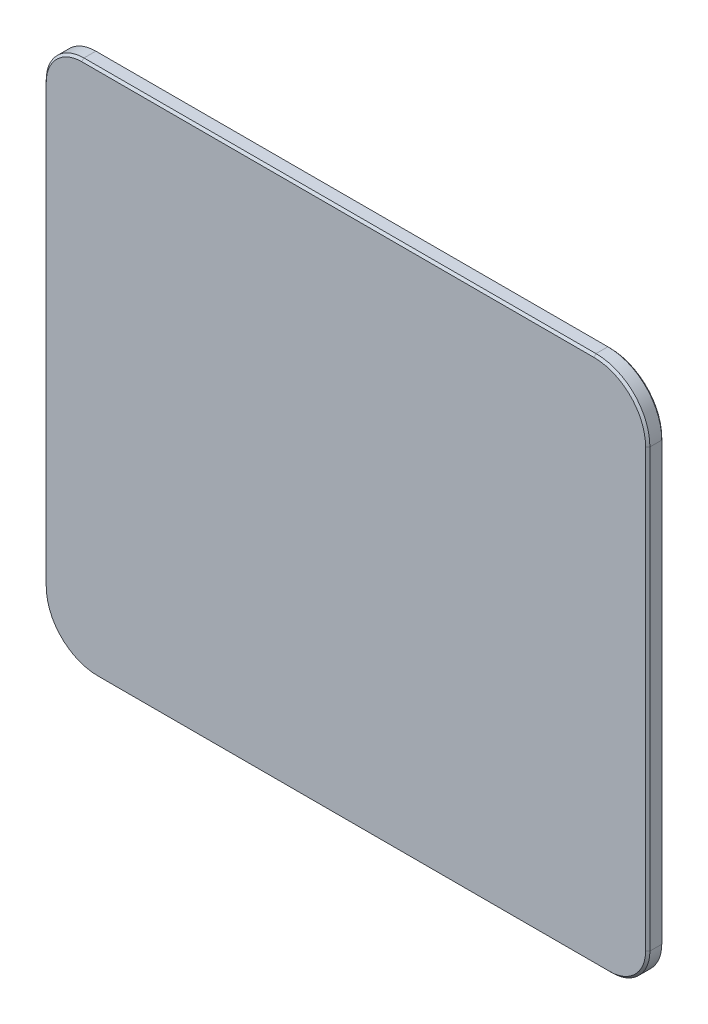
ISO-10303-21;
HEADER;
FILE_DESCRIPTION(('STEP AP214'),'2;1');
FILE_NAME('part.step','',(''),(''),'','','');
FILE_SCHEMA(('AUTOMOTIVE_DESIGN { 1 0 10303 214 1 1 1 1 }'));
ENDSEC;
DATA;
#1=APPLICATION_CONTEXT('core data for automotive mechanical design processes');
#2=APPLICATION_PROTOCOL_DEFINITION('international standard','automotive_design',2000,#1);
#3=PRODUCT_CONTEXT('',#1,'mechanical');
#4=PRODUCT('Part','Part','',(#3));
#5=PRODUCT_RELATED_PRODUCT_CATEGORY('part','',(#4));
#6=PRODUCT_DEFINITION_FORMATION('','',#4);
#7=PRODUCT_DEFINITION_CONTEXT('part definition',#1,'design');
#8=PRODUCT_DEFINITION('design','',#6,#7);
#9=PRODUCT_DEFINITION_SHAPE('','',#8);
#10=(LENGTH_UNIT() NAMED_UNIT(*) SI_UNIT(.MILLI.,.METRE.));
#11=(NAMED_UNIT(*) PLANE_ANGLE_UNIT() SI_UNIT($,.RADIAN.));
#12=(NAMED_UNIT(*) SI_UNIT($,.STERADIAN.) SOLID_ANGLE_UNIT());
#13=UNCERTAINTY_MEASURE_WITH_UNIT(LENGTH_MEASURE(1.E-05),#10,'distance_accuracy_value','');
#14=(GEOMETRIC_REPRESENTATION_CONTEXT(3) GLOBAL_UNCERTAINTY_ASSIGNED_CONTEXT((#13)) GLOBAL_UNIT_ASSIGNED_CONTEXT((#10,
#11,#12)) REPRESENTATION_CONTEXT('',''));
#15=CARTESIAN_POINT('',(0.,0.,0.));
#16=DIRECTION('',(0.,0.,1.));
#17=DIRECTION('',(1.,0.,0.));
#18=AXIS2_PLACEMENT_3D('',#15,#16,#17);
#19=CARTESIAN_POINT('',(19.,15.5,0.1));
#20=DIRECTION('',(0.,0.,-1.));
#21=DIRECTION('',(-1.,0.,0.));
#22=AXIS2_PLACEMENT_3D('',#19,#20,#21);
#23=CYLINDRICAL_SURFACE('',#22,5.);
#24=DIRECTION('',(0.,0.,-1.));
#25=VECTOR('',#24,1.);
#26=CARTESIAN_POINT('',(19.,20.5,0.12));
#27=LINE('',#26,#25);
#28=CARTESIAN_POINT('',(19.,20.5,0.12));
#29=VERTEX_POINT('',#28);
#30=CARTESIAN_POINT('',(19.,20.5,0.1));
#31=VERTEX_POINT('',#30);
#32=EDGE_CURVE('E370',#29,#31,#27,.T.);
#33=ORIENTED_EDGE('',*,*,#32,.F.);
#34=CARTESIAN_POINT('',(19.,15.5,0.12));
#35=DIRECTION('',(0.,0.,-1.));
#36=DIRECTION('',(0.,1.,0.));
#37=AXIS2_PLACEMENT_3D('',#34,#35,#36);
#38=CIRCLE('',#37,5.);
#39=CARTESIAN_POINT('',(24.,15.5,0.12));
#40=VERTEX_POINT('',#39);
#41=EDGE_CURVE('E391',#29,#40,#38,.T.);
#42=ORIENTED_EDGE('',*,*,#41,.T.);
#43=DIRECTION('',(0.,0.,1.));
#44=VECTOR('',#43,1.);
#45=CARTESIAN_POINT('',(24.,15.5,0.1));
#46=LINE('',#45,#44);
#47=CARTESIAN_POINT('',(24.,15.5,0.1));
#48=VERTEX_POINT('',#47);
#49=EDGE_CURVE('E11',#48,#40,#46,.T.);
#50=ORIENTED_EDGE('',*,*,#49,.F.);
#51=CARTESIAN_POINT('',(19.,15.5,0.1));
#52=DIRECTION('',(0.,0.,1.));
#53=DIRECTION('',(1.,0.,0.));
#54=AXIS2_PLACEMENT_3D('',#51,#52,#53);
#55=CIRCLE('',#54,5.);
#56=EDGE_CURVE('E479',#48,#31,#55,.T.);
#57=ORIENTED_EDGE('',*,*,#56,.T.);
#58=EDGE_LOOP('',(#33,#42,#50,#57));
#59=FACE_BOUND('',#58,.T.);
#60=ADVANCED_FACE('F16',(#59),#23,.T.);
#61=CARTESIAN_POINT('',(24.,7.628902816431,0.1));
#62=DIRECTION('',(-1.,0.,0.));
#63=DIRECTION('',(0.,0.,1.));
#64=AXIS2_PLACEMENT_3D('',#61,#62,#63);
#65=PLANE('',#64);
#66=ORIENTED_EDGE('',*,*,#49,.T.);
#67=DIRECTION('',(0.,-1.,0.));
#68=VECTOR('',#67,1.);
#69=CARTESIAN_POINT('',(24.,15.5,0.12));
#70=LINE('',#69,#68);
#71=CARTESIAN_POINT('',(24.,7.628902816431,0.12));
#72=VERTEX_POINT('',#71);
#73=EDGE_CURVE('E465',#40,#72,#70,.T.);
#74=ORIENTED_EDGE('',*,*,#73,.T.);
#75=DIRECTION('',(0.,4.130029651606E-12,-1.));
#76=VECTOR('',#75,1.);
#77=CARTESIAN_POINT('',(24.,7.628902816431,0.12));
#78=LINE('',#77,#76);
#79=CARTESIAN_POINT('',(24.,7.628902816431,0.1));
#80=VERTEX_POINT('',#79);
#81=EDGE_CURVE('E27',#72,#80,#78,.T.);
#82=ORIENTED_EDGE('',*,*,#81,.T.);
#83=DIRECTION('',(0.,-1.,0.));
#84=VECTOR('',#83,1.);
#85=CARTESIAN_POINT('',(24.,15.5,0.1));
#86=LINE('',#85,#84);
#87=EDGE_CURVE('E483',#48,#80,#86,.T.);
#88=ORIENTED_EDGE('',*,*,#87,.F.);
#89=EDGE_LOOP('',(#66,#74,#82,#88));
#90=FACE_BOUND('',#89,.T.);
#91=ADVANCED_FACE('F581',(#90),#65,.F.);
#92=CARTESIAN_POINT('',(-1.,0.4874743878878,0.1));
#93=DIRECTION('',(0.,0.,-1.));
#94=DIRECTION('',(-1.,0.,0.));
#95=AXIS2_PLACEMENT_3D('',#92,#93,#94);
#96=CYLINDRICAL_SURFACE('',#95,26.);
#97=ORIENTED_EDGE('',*,*,#81,.F.);
#98=CARTESIAN_POINT('',(-1.,0.4874743878878,0.12));
#99=DIRECTION('',(0.,0.,-1.));
#100=DIRECTION('',(0.961538461538471,0.274670324174692,0.));
#101=AXIS2_PLACEMENT_3D('',#98,#99,#100);
#102=CIRCLE('',#101,26.);
#103=CARTESIAN_POINT('',(25.,0.4874743878878,0.12));
#104=VERTEX_POINT('',#103);
#105=EDGE_CURVE('E461',#72,#104,#102,.T.);
#106=ORIENTED_EDGE('',*,*,#105,.T.);
#107=CARTESIAN_POINT('',(-1.,0.4874743878878,0.12));
#108=DIRECTION('',(0.,0.,-1.));
#109=DIRECTION('',(1.,0.,0.));
#110=AXIS2_PLACEMENT_3D('',#107,#108,#109);
#111=CIRCLE('',#110,26.);
#112=CARTESIAN_POINT('',(24.,-6.653954040655,0.12));
#113=VERTEX_POINT('',#112);
#114=EDGE_CURVE('E458',#104,#113,#111,.T.);
#115=ORIENTED_EDGE('',*,*,#114,.T.);
#116=DIRECTION('',(0.,-3.01980662698E-12,1.));
#117=VECTOR('',#116,1.);
#118=CARTESIAN_POINT('',(24.,-6.653954040655,0.1));
#119=LINE('',#118,#117);
#120=CARTESIAN_POINT('',(24.,-6.653954040655,0.1));
#121=VERTEX_POINT('',#120);
#122=EDGE_CURVE('E41',#121,#113,#119,.T.);
#123=ORIENTED_EDGE('',*,*,#122,.F.);
#124=CARTESIAN_POINT('',(-1.,0.4874743878878,0.1));
#125=DIRECTION('',(0.,0.,1.));
#126=DIRECTION('',(0.961538461538471,-0.274670324174692,0.));
#127=AXIS2_PLACEMENT_3D('',#124,#125,#126);
#128=CIRCLE('',#127,26.);
#129=CARTESIAN_POINT('',(25.,0.4874743878878,0.1));
#130=VERTEX_POINT('',#129);
#131=EDGE_CURVE('E472',#121,#130,#128,.T.);
#132=ORIENTED_EDGE('',*,*,#131,.T.);
#133=CARTESIAN_POINT('',(-1.,0.4874743878878,0.1));
#134=DIRECTION('',(0.,0.,1.));
#135=DIRECTION('',(1.,0.,0.));
#136=AXIS2_PLACEMENT_3D('',#133,#134,#135);
#137=CIRCLE('',#136,26.);
#138=EDGE_CURVE('E541',#130,#80,#137,.T.);
#139=ORIENTED_EDGE('',*,*,#138,.T.);
#140=EDGE_LOOP('',(#97,#106,#115,#123,#132,#139));
#141=FACE_BOUND('',#140,.T.);
#142=ADVANCED_FACE('F591',(#141),#96,.T.);
#143=CARTESIAN_POINT('',(-19.,15.5,0.1));
#144=DIRECTION('',(0.,0.,-1.));
#145=DIRECTION('',(-1.,0.,0.));
#146=AXIS2_PLACEMENT_3D('',#143,#144,#145);
#147=CYLINDRICAL_SURFACE('',#146,5.);
#148=DIRECTION('',(0.,0.,-1.));
#149=VECTOR('',#148,1.);
#150=CARTESIAN_POINT('',(-24.,15.5,0.12));
#151=LINE('',#150,#149);
#152=CARTESIAN_POINT('',(-24.,15.5,0.12));
#153=VERTEX_POINT('',#152);
#154=CARTESIAN_POINT('',(-24.,15.5,0.1));
#155=VERTEX_POINT('',#154);
#156=EDGE_CURVE('E397',#153,#155,#151,.T.);
#157=ORIENTED_EDGE('',*,*,#156,.F.);
#158=CARTESIAN_POINT('',(-19.,15.5,0.12));
#159=DIRECTION('',(0.,0.,-1.));
#160=DIRECTION('',(-1.,0.,0.));
#161=AXIS2_PLACEMENT_3D('',#158,#159,#160);
#162=CIRCLE('',#161,5.);
#163=CARTESIAN_POINT('',(-19.,20.5,0.12));
#164=VERTEX_POINT('',#163);
#165=EDGE_CURVE('E509',#153,#164,#162,.T.);
#166=ORIENTED_EDGE('',*,*,#165,.T.);
#167=DIRECTION('',(0.,0.,1.));
#168=VECTOR('',#167,1.);
#169=CARTESIAN_POINT('',(-19.,20.5,0.1));
#170=LINE('',#169,#168);
#171=CARTESIAN_POINT('',(-19.,20.5,0.1));
#172=VERTEX_POINT('',#171);
#173=EDGE_CURVE('E281',#172,#164,#170,.T.);
#174=ORIENTED_EDGE('',*,*,#173,.F.);
#175=CARTESIAN_POINT('',(-19.,15.5,0.1));
#176=DIRECTION('',(0.,0.,1.));
#177=DIRECTION('',(0.,1.,0.));
#178=AXIS2_PLACEMENT_3D('',#175,#176,#177);
#179=CIRCLE('',#178,5.);
#180=EDGE_CURVE('E484',#172,#155,#179,.T.);
#181=ORIENTED_EDGE('',*,*,#180,.T.);
#182=EDGE_LOOP('',(#157,#166,#174,#181));
#183=FACE_BOUND('',#182,.T.);
#184=ADVANCED_FACE('F776',(#183),#147,.T.);
#185=CARTESIAN_POINT('',(-24.,15.5,0.1));
#186=DIRECTION('',(1.,0.,0.));
#187=DIRECTION('',(0.,1.,0.));
#188=AXIS2_PLACEMENT_3D('',#185,#186,#187);
#189=PLANE('',#188);
#190=DIRECTION('',(0.,4.218847493576E-12,1.));
#191=VECTOR('',#190,1.);
#192=CARTESIAN_POINT('',(-24.,7.628902816431,0.1));
#193=LINE('',#192,#191);
#194=CARTESIAN_POINT('',(-24.,7.628902816431,0.1));
#195=VERTEX_POINT('',#194);
#196=CARTESIAN_POINT('',(-24.,7.628902816431,0.12));
#197=VERTEX_POINT('',#196);
#198=EDGE_CURVE('E400',#195,#197,#193,.T.);
#199=ORIENTED_EDGE('',*,*,#198,.T.);
#200=DIRECTION('',(0.,1.,0.));
#201=VECTOR('',#200,1.);
#202=CARTESIAN_POINT('',(-24.,7.628902816431,0.12));
#203=LINE('',#202,#201);
#204=EDGE_CURVE('E457',#197,#153,#203,.T.);
#205=ORIENTED_EDGE('',*,*,#204,.T.);
#206=ORIENTED_EDGE('',*,*,#156,.T.);
#207=DIRECTION('',(0.,1.,0.));
#208=VECTOR('',#207,1.);
#209=CARTESIAN_POINT('',(-24.,7.628902816431,0.1));
#210=LINE('',#209,#208);
#211=EDGE_CURVE('E395',#195,#155,#210,.T.);
#212=ORIENTED_EDGE('',*,*,#211,.F.);
#213=EDGE_LOOP('',(#199,#205,#206,#212));
#214=FACE_BOUND('',#213,.T.);
#215=ADVANCED_FACE('F829',(#214),#189,.F.);
#216=CARTESIAN_POINT('',(1.,0.4874743878878,0.1));
#217=DIRECTION('',(0.,0.,-1.));
#218=DIRECTION('',(-1.,0.,0.));
#219=AXIS2_PLACEMENT_3D('',#216,#217,#218);
#220=CYLINDRICAL_SURFACE('',#219,26.);
#221=DIRECTION('',(0.,-3.01980662698E-12,-1.));
#222=VECTOR('',#221,1.);
#223=CARTESIAN_POINT('',(-24.,-6.653954040655,0.12));
#224=LINE('',#223,#222);
#225=CARTESIAN_POINT('',(-24.,-6.653954040655,0.12));
#226=VERTEX_POINT('',#225);
#227=CARTESIAN_POINT('',(-24.,-6.653954040655,0.1));
#228=VERTEX_POINT('',#227);
#229=EDGE_CURVE('E538',#226,#228,#224,.T.);
#230=ORIENTED_EDGE('',*,*,#229,.F.);
#231=CARTESIAN_POINT('',(1.,0.4874743878878,0.12));
#232=DIRECTION('',(0.,0.,-1.));
#233=DIRECTION('',(-0.961538461538471,-0.274670324174692,0.));
#234=AXIS2_PLACEMENT_3D('',#231,#232,#233);
#235=CIRCLE('',#234,26.);
#236=CARTESIAN_POINT('',(-25.,0.4874743878878,0.12));
#237=VERTEX_POINT('',#236);
#238=EDGE_CURVE('E331',#226,#237,#235,.T.);
#239=ORIENTED_EDGE('',*,*,#238,.T.);
#240=CARTESIAN_POINT('',(1.,0.4874743878878,0.12));
#241=DIRECTION('',(0.,0.,-1.));
#242=DIRECTION('',(-1.,0.,0.));
#243=AXIS2_PLACEMENT_3D('',#240,#241,#242);
#244=CIRCLE('',#243,26.);
#245=EDGE_CURVE('E335',#237,#197,#244,.T.);
#246=ORIENTED_EDGE('',*,*,#245,.T.);
#247=ORIENTED_EDGE('',*,*,#198,.F.);
#248=CARTESIAN_POINT('',(1.,0.4874743878878,0.1));
#249=DIRECTION('',(0.,0.,1.));
#250=DIRECTION('',(-0.961538461538471,0.274670324174692,0.));
#251=AXIS2_PLACEMENT_3D('',#248,#249,#250);
#252=CIRCLE('',#251,26.);
#253=CARTESIAN_POINT('',(-25.,0.4874743878878,0.1));
#254=VERTEX_POINT('',#253);
#255=EDGE_CURVE('E392',#195,#254,#252,.T.);
#256=ORIENTED_EDGE('',*,*,#255,.T.);
#257=CARTESIAN_POINT('',(1.,0.4874743878878,0.1));
#258=DIRECTION('',(0.,0.,1.));
#259=DIRECTION('',(-1.,0.,0.));
#260=AXIS2_PLACEMENT_3D('',#257,#258,#259);
#261=CIRCLE('',#260,26.);
#262=EDGE_CURVE('E396',#254,#228,#261,.T.);
#263=ORIENTED_EDGE('',*,*,#262,.T.);
#264=EDGE_LOOP('',(#230,#239,#246,#247,#256,#263));
#265=FACE_BOUND('',#264,.T.);
#266=ADVANCED_FACE('F1007',(#265),#220,.T.);
#267=CARTESIAN_POINT('',(-24.,-6.653954040655,0.1));
#268=DIRECTION('',(1.,0.,0.));
#269=DIRECTION('',(0.,1.,0.));
#270=AXIS2_PLACEMENT_3D('',#267,#268,#269);
#271=PLANE('',#270);
#272=DIRECTION('',(0.,0.,1.));
#273=VECTOR('',#272,1.);
#274=CARTESIAN_POINT('',(-24.,-15.5,0.1));
#275=LINE('',#274,#273);
#276=CARTESIAN_POINT('',(-24.,-15.5,0.1));
#277=VERTEX_POINT('',#276);
#278=CARTESIAN_POINT('',(-24.,-15.5,0.12));
#279=VERTEX_POINT('',#278);
#280=EDGE_CURVE('E549',#277,#279,#275,.T.);
#281=ORIENTED_EDGE('',*,*,#280,.T.);
#282=DIRECTION('',(0.,1.,0.));
#283=VECTOR('',#282,1.);
#284=CARTESIAN_POINT('',(-24.,-15.5,0.12));
#285=LINE('',#284,#283);
#286=EDGE_CURVE('E334',#279,#226,#285,.T.);
#287=ORIENTED_EDGE('',*,*,#286,.T.);
#288=ORIENTED_EDGE('',*,*,#229,.T.);
#289=DIRECTION('',(0.,1.,0.));
#290=VECTOR('',#289,1.);
#291=CARTESIAN_POINT('',(-24.,-15.5,0.1));
#292=LINE('',#291,#290);
#293=EDGE_CURVE('E442',#277,#228,#292,.T.);
#294=ORIENTED_EDGE('',*,*,#293,.F.);
#295=EDGE_LOOP('',(#281,#287,#288,#294));
#296=FACE_BOUND('',#295,.T.);
#297=ADVANCED_FACE('F720',(#296),#271,.F.);
#298=CARTESIAN_POINT('',(-19.,-15.5,0.1));
#299=DIRECTION('',(0.,0.,-1.));
#300=DIRECTION('',(-1.,0.,0.));
#301=AXIS2_PLACEMENT_3D('',#298,#299,#300);
#302=CYLINDRICAL_SURFACE('',#301,5.);
#303=DIRECTION('',(0.,0.,-1.));
#304=VECTOR('',#303,1.);
#305=CARTESIAN_POINT('',(-19.,-20.5,0.12));
#306=LINE('',#305,#304);
#307=CARTESIAN_POINT('',(-19.,-20.5,0.12));
#308=VERTEX_POINT('',#307);
#309=CARTESIAN_POINT('',(-19.,-20.5,0.1));
#310=VERTEX_POINT('',#309);
#311=EDGE_CURVE('E496',#308,#310,#306,.T.);
#312=ORIENTED_EDGE('',*,*,#311,.F.);
#313=CARTESIAN_POINT('',(-19.,-15.5,0.12));
#314=DIRECTION('',(0.,0.,-1.));
#315=DIRECTION('',(0.,-1.,0.));
#316=AXIS2_PLACEMENT_3D('',#313,#314,#315);
#317=CIRCLE('',#316,5.);
#318=EDGE_CURVE('E349',#308,#279,#317,.T.);
#319=ORIENTED_EDGE('',*,*,#318,.T.);
#320=ORIENTED_EDGE('',*,*,#280,.F.);
#321=CARTESIAN_POINT('',(-19.,-15.5,0.1));
#322=DIRECTION('',(0.,0.,1.));
#323=DIRECTION('',(-1.,0.,0.));
#324=AXIS2_PLACEMENT_3D('',#321,#322,#323);
#325=CIRCLE('',#324,5.);
#326=EDGE_CURVE('E446',#277,#310,#325,.T.);
#327=ORIENTED_EDGE('',*,*,#326,.T.);
#328=EDGE_LOOP('',(#312,#319,#320,#327));
#329=FACE_BOUND('',#328,.T.);
#330=ADVANCED_FACE('F713',(#329),#302,.T.);
#331=CARTESIAN_POINT('',(-19.,-20.5,0.1));
#332=DIRECTION('',(0.,1.,0.));
#333=DIRECTION('',(1.,0.,0.));
#334=AXIS2_PLACEMENT_3D('',#331,#332,#333);
#335=PLANE('',#334);
#336=DIRECTION('',(0.,0.,1.));
#337=VECTOR('',#336,1.);
#338=CARTESIAN_POINT('',(19.,-20.5,0.1));
#339=LINE('',#338,#337);
#340=CARTESIAN_POINT('',(19.,-20.5,0.1));
#341=VERTEX_POINT('',#340);
#342=CARTESIAN_POINT('',(19.,-20.5,0.12));
#343=VERTEX_POINT('',#342);
#344=EDGE_CURVE('E330',#341,#343,#339,.T.);
#345=ORIENTED_EDGE('',*,*,#344,.T.);
#346=DIRECTION('',(-1.,0.,0.));
#347=VECTOR('',#346,1.);
#348=CARTESIAN_POINT('',(19.,-20.5,0.12));
#349=LINE('',#348,#347);
#350=EDGE_CURVE('E429',#343,#308,#349,.T.);
#351=ORIENTED_EDGE('',*,*,#350,.T.);
#352=ORIENTED_EDGE('',*,*,#311,.T.);
#353=DIRECTION('',(-1.,0.,0.));
#354=VECTOR('',#353,1.);
#355=CARTESIAN_POINT('',(19.,-20.5,0.1));
#356=LINE('',#355,#354);
#357=EDGE_CURVE('E493',#341,#310,#356,.T.);
#358=ORIENTED_EDGE('',*,*,#357,.F.);
#359=EDGE_LOOP('',(#345,#351,#352,#358));
#360=FACE_BOUND('',#359,.T.);
#361=ADVANCED_FACE('F719',(#360),#335,.F.);
#362=CARTESIAN_POINT('',(19.,-15.5,0.1));
#363=DIRECTION('',(0.,0.,-1.));
#364=DIRECTION('',(-1.,0.,0.));
#365=AXIS2_PLACEMENT_3D('',#362,#363,#364);
#366=CYLINDRICAL_SURFACE('',#365,5.);
#367=DIRECTION('',(0.,0.,-1.));
#368=VECTOR('',#367,1.);
#369=CARTESIAN_POINT('',(24.,-15.5,0.12));
#370=LINE('',#369,#368);
#371=CARTESIAN_POINT('',(24.,-15.5,0.12));
#372=VERTEX_POINT('',#371);
#373=CARTESIAN_POINT('',(24.,-15.5,0.1));
#374=VERTEX_POINT('',#373);
#375=EDGE_CURVE('E254',#372,#374,#370,.T.);
#376=ORIENTED_EDGE('',*,*,#375,.F.);
#377=CARTESIAN_POINT('',(19.,-15.5,0.12));
#378=DIRECTION('',(0.,0.,-1.));
#379=DIRECTION('',(1.,0.,0.));
#380=AXIS2_PLACEMENT_3D('',#377,#378,#379);
#381=CIRCLE('',#380,5.);
#382=EDGE_CURVE('E433',#372,#343,#381,.T.);
#383=ORIENTED_EDGE('',*,*,#382,.T.);
#384=ORIENTED_EDGE('',*,*,#344,.F.);
#385=CARTESIAN_POINT('',(19.,-15.5,0.1));
#386=DIRECTION('',(0.,0.,1.));
#387=DIRECTION('',(0.,-1.,0.));
#388=AXIS2_PLACEMENT_3D('',#385,#386,#387);
#389=CIRCLE('',#388,5.);
#390=EDGE_CURVE('E520',#341,#374,#389,.T.);
#391=ORIENTED_EDGE('',*,*,#390,.T.);
#392=EDGE_LOOP('',(#376,#383,#384,#391));
#393=FACE_BOUND('',#392,.T.);
#394=ADVANCED_FACE('F745',(#393),#366,.T.);
#395=CARTESIAN_POINT('',(24.,-15.5,0.1));
#396=DIRECTION('',(-1.,0.,0.));
#397=DIRECTION('',(0.,0.,1.));
#398=AXIS2_PLACEMENT_3D('',#395,#396,#397);
#399=PLANE('',#398);
#400=ORIENTED_EDGE('',*,*,#122,.T.);
#401=DIRECTION('',(0.,-1.,0.));
#402=VECTOR('',#401,1.);
#403=CARTESIAN_POINT('',(24.,-6.653954040655,0.12));
#404=LINE('',#403,#402);
#405=EDGE_CURVE('E462',#113,#372,#404,.T.);
#406=ORIENTED_EDGE('',*,*,#405,.T.);
#407=ORIENTED_EDGE('',*,*,#375,.T.);
#408=DIRECTION('',(0.,-1.,0.));
#409=VECTOR('',#408,1.);
#410=CARTESIAN_POINT('',(24.,-6.653954040655,0.1));
#411=LINE('',#410,#409);
#412=EDGE_CURVE('E468',#121,#374,#411,.T.);
#413=ORIENTED_EDGE('',*,*,#412,.F.);
#414=EDGE_LOOP('',(#400,#406,#407,#413));
#415=FACE_BOUND('',#414,.T.);
#416=ADVANCED_FACE('F750',(#415),#399,.F.);
#417=CARTESIAN_POINT('',(0.,0.,0.1));
#418=DIRECTION('',(0.,0.,-1.));
#419=DIRECTION('',(0.,-1.,0.));
#420=AXIS2_PLACEMENT_3D('',#417,#418,#419);
#421=PLANE('',#420);
#422=ORIENTED_EDGE('',*,*,#390,.F.);
#423=ORIENTED_EDGE('',*,*,#357,.T.);
#424=ORIENTED_EDGE('',*,*,#326,.F.);
#425=ORIENTED_EDGE('',*,*,#293,.T.);
#426=ORIENTED_EDGE('',*,*,#262,.F.);
#427=ORIENTED_EDGE('',*,*,#255,.F.);
#428=ORIENTED_EDGE('',*,*,#211,.T.);
#429=ORIENTED_EDGE('',*,*,#180,.F.);
#430=DIRECTION('',(1.,0.,0.));
#431=VECTOR('',#430,1.);
#432=CARTESIAN_POINT('',(-19.,20.5,0.1));
#433=LINE('',#432,#431);
#434=EDGE_CURVE('E317',#172,#31,#433,.T.);
#435=ORIENTED_EDGE('',*,*,#434,.T.);
#436=ORIENTED_EDGE('',*,*,#56,.F.);
#437=ORIENTED_EDGE('',*,*,#87,.T.);
#438=ORIENTED_EDGE('',*,*,#138,.F.);
#439=ORIENTED_EDGE('',*,*,#131,.F.);
#440=ORIENTED_EDGE('',*,*,#412,.T.);
#441=EDGE_LOOP('',(#422,#423,#424,#425,#426,#427,#428,#429,#435,#436,#437,#438,#439,#440));
#442=FACE_BOUND('',#441,.T.);
#443=ADVANCED_FACE('F599',(#442),#421,.T.);
#444=CARTESIAN_POINT('',(19.,20.5,0.1));
#445=DIRECTION('',(0.,-1.,0.));
#446=DIRECTION('',(0.,0.,-1.));
#447=AXIS2_PLACEMENT_3D('',#444,#445,#446);
#448=PLANE('',#447);
#449=ORIENTED_EDGE('',*,*,#173,.T.);
#450=DIRECTION('',(1.,0.,0.));
#451=VECTOR('',#450,1.);
#452=CARTESIAN_POINT('',(-19.,20.5,0.12));
#453=LINE('',#452,#451);
#454=EDGE_CURVE('E386',#164,#29,#453,.T.);
#455=ORIENTED_EDGE('',*,*,#454,.T.);
#456=ORIENTED_EDGE('',*,*,#32,.T.);
#457=ORIENTED_EDGE('',*,*,#434,.F.);
#458=EDGE_LOOP('',(#449,#455,#456,#457));
#459=FACE_BOUND('',#458,.T.);
#460=ADVANCED_FACE('F736',(#459),#448,.F.);
#461=CARTESIAN_POINT('',(-0.75,24.4,0.2));
#462=DIRECTION('',(0.,0.707106781186548,-0.707106781186548));
#463=DIRECTION('',(-1.,0.,0.));
#464=AXIS2_PLACEMENT_3D('',#461,#462,#463);
#465=PLANE('',#464);
#466=DIRECTION('',(8.52791882667797E-09,0.707106781667298,0.707106780705798));
#467=VECTOR('',#466,1.);
#468=CARTESIAN_POINT('',(-24.49999999591,24.32,0.12));
#469=LINE('',#468,#467);
#470=CARTESIAN_POINT('',(-24.5,24.32,0.1199999999998));
#471=VERTEX_POINT('',#470);
#472=CARTESIAN_POINT('',(-24.49999999378,24.5,0.2999999999998));
#473=VERTEX_POINT('',#472);
#474=EDGE_CURVE('E284',#471,#473,#469,.T.);
#475=ORIENTED_EDGE('',*,*,#474,.T.);
#476=DIRECTION('',(-1.,0.,0.));
#477=VECTOR('',#476,1.);
#478=CARTESIAN_POINT('',(22.99999998149,24.49999999976,0.2999999995109));
#479=LINE('',#478,#477);
#480=CARTESIAN_POINT('',(22.99999998157,24.5,0.2999999999999));
#481=VERTEX_POINT('',#480);
#482=EDGE_CURVE('E270',#481,#473,#479,.T.);
#483=ORIENTED_EDGE('',*,*,#482,.F.);
#484=DIRECTION('',(2.49128455037899E-08,-0.707106781667297,-0.707106780705797));
#485=VECTOR('',#484,1.);
#486=CARTESIAN_POINT('',(22.99999998149,24.49999999976,0.2999999995109));
#487=LINE('',#486,#485);
#488=CARTESIAN_POINT('',(23.,24.32,0.1199999999998));
#489=VERTEX_POINT('',#488);
#490=EDGE_CURVE('E424',#481,#489,#487,.T.);
#491=ORIENTED_EDGE('',*,*,#490,.T.);
#492=DIRECTION('',(-1.,0.,0.));
#493=VECTOR('',#492,1.);
#494=CARTESIAN_POINT('',(22.99999998784,24.32,0.1199999999999));
#495=LINE('',#494,#493);
#496=EDGE_CURVE('E288',#489,#471,#495,.T.);
#497=ORIENTED_EDGE('',*,*,#496,.T.);
#498=EDGE_LOOP('',(#475,#483,#491,#497));
#499=FACE_BOUND('',#498,.T.);
#500=ADVANCED_FACE('F286',(#499),#465,.T.);
#501=CARTESIAN_POINT('',(-24.5,24.5,1.6));
#502=DIRECTION('',(0.,-1.,0.));
#503=DIRECTION('',(0.,0.,-1.));
#504=AXIS2_PLACEMENT_3D('',#501,#502,#503);
#505=PLANE('',#504);
#506=DIRECTION('',(-2.861168270731E-09,2.22102740141E-10,1.));
#507=VECTOR('',#506,1.);
#508=CARTESIAN_POINT('',(-24.49999999374,24.49999999976,0.2999999995108));
#509=LINE('',#508,#507);
#510=CARTESIAN_POINT('',(-24.49999999689,24.5,1.4));
#511=VERTEX_POINT('',#510);
#512=EDGE_CURVE('E275',#473,#511,#509,.T.);
#513=ORIENTED_EDGE('',*,*,#512,.T.);
#514=DIRECTION('',(1.,0.,0.));
#515=VECTOR('',#514,1.);
#516=CARTESIAN_POINT('',(-24.49999999689,24.5,1.4));
#517=LINE('',#516,#515);
#518=CARTESIAN_POINT('',(22.99999999079,24.5,1.4));
#519=VERTEX_POINT('',#518);
#520=EDGE_CURVE('E379',#511,#519,#517,.T.);
#521=ORIENTED_EDGE('',*,*,#520,.T.);
#522=DIRECTION('',(-8.446428199566E-09,-2.22102740141E-10,-1.));
#523=VECTOR('',#522,1.);
#524=CARTESIAN_POINT('',(22.99999999079,24.5,1.4));
#525=LINE('',#524,#523);
#526=EDGE_CURVE('E277',#519,#481,#525,.T.);
#527=ORIENTED_EDGE('',*,*,#526,.T.);
#528=ORIENTED_EDGE('',*,*,#482,.T.);
#529=EDGE_LOOP('',(#513,#521,#527,#528));
#530=FACE_BOUND('',#529,.T.);
#531=ADVANCED_FACE('F272',(#530),#505,.F.);
#532=CARTESIAN_POINT('',(23.,19.5,1.6));
#533=DIRECTION('',(0.,0.,-1.));
#534=DIRECTION('',(-1.,0.,0.));
#535=AXIS2_PLACEMENT_3D('',#532,#533,#534);
#536=CYLINDRICAL_SURFACE('',#535,5.);
#537=ORIENTED_EDGE('',*,*,#526,.F.);
#538=CARTESIAN_POINT('',(23.,19.5,1.4));
#539=DIRECTION('',(0.,0.,-1.));
#540=DIRECTION('',(-3.685605065584E-09,1.,0.));
#541=AXIS2_PLACEMENT_3D('',#538,#539,#540);
#542=CIRCLE('',#541,5.);
#543=CARTESIAN_POINT('',(28.,19.49999999228,1.4));
#544=VERTEX_POINT('',#543);
#545=EDGE_CURVE('E322',#519,#544,#542,.T.);
#546=ORIENTED_EDGE('',*,*,#545,.T.);
#547=DIRECTION('',(2.331129227957E-10,7.078733555616E-09,1.));
#548=VECTOR('',#547,1.);
#549=CARTESIAN_POINT('',(27.99999999974,19.49999998449,0.2999999994875));
#550=LINE('',#549,#548);
#551=CARTESIAN_POINT('',(27.99999999974,19.49999998449,0.2999999994875));
#552=VERTEX_POINT('',#551);
#553=EDGE_CURVE('E419',#552,#544,#550,.T.);
#554=ORIENTED_EDGE('',*,*,#553,.F.);
#555=CARTESIAN_POINT('',(23.,19.5,0.2999999999999));
#556=DIRECTION('',(0.,0.,1.));
#557=DIRECTION('',(1.,-3.089472500051E-09,0.));
#558=AXIS2_PLACEMENT_3D('',#555,#556,#557);
#559=CIRCLE('',#558,5.);
#560=EDGE_CURVE('E421',#552,#481,#559,.T.);
#561=ORIENTED_EDGE('',*,*,#560,.T.);
#562=EDGE_LOOP('',(#537,#546,#554,#561));
#563=FACE_BOUND('',#562,.T.);
#564=ADVANCED_FACE('F791',(#563),#536,.T.);
#565=CARTESIAN_POINT('',(23.,19.5,0.2099999999998));
#566=DIRECTION('',(0.,0.,1.));
#567=DIRECTION('',(0.,-1.,0.));
#568=AXIS2_PLACEMENT_3D('',#565,#566,#567);
#569=CONICAL_SURFACE('',#568,4.91,0.7853981633973);
#570=ORIENTED_EDGE('',*,*,#490,.F.);
#571=ORIENTED_EDGE('',*,*,#560,.F.);
#572=DIRECTION('',(0.707106781689297,-2.08853280608899E-08,0.707106780683797));
#573=VECTOR('',#572,1.);
#574=CARTESIAN_POINT('',(27.82,19.49999998981,0.1199999999999));
#575=LINE('',#574,#573);
#576=CARTESIAN_POINT('',(27.82,19.49999998981,0.1199999999999));
#577=VERTEX_POINT('',#576);
#578=EDGE_CURVE('E542',#577,#552,#575,.T.);
#579=ORIENTED_EDGE('',*,*,#578,.F.);
#580=CARTESIAN_POINT('',(23.,19.5,0.1199999999998));
#581=DIRECTION('',(0.,0.,1.));
#582=DIRECTION('',(1.,0.,0.));
#583=AXIS2_PLACEMENT_3D('',#580,#581,#582);
#584=CIRCLE('',#583,4.82);
#585=EDGE_CURVE('E341',#577,#489,#584,.T.);
#586=ORIENTED_EDGE('',*,*,#585,.T.);
#587=EDGE_LOOP('',(#570,#571,#579,#586));
#588=FACE_BOUND('',#587,.T.);
#589=ADVANCED_FACE('F785',(#588),#569,.T.);
#590=CARTESIAN_POINT('',(27.9,-0.75,0.2));
#591=DIRECTION('',(0.707106781186548,0.,-0.707106781186548));
#592=DIRECTION('',(0.,-1.,0.));
#593=AXIS2_PLACEMENT_3D('',#590,#591,#592);
#594=PLANE('',#593);
#595=ORIENTED_EDGE('',*,*,#578,.T.);
#596=DIRECTION('',(0.,1.,0.));
#597=VECTOR('',#596,1.);
#598=CARTESIAN_POINT('',(27.99999999974,-20.99999998772,0.2999999994875));
#599=LINE('',#598,#597);
#600=CARTESIAN_POINT('',(28.,-20.99999998779,0.2999999999998));
#601=VERTEX_POINT('',#600);
#602=EDGE_CURVE('E546',#601,#552,#599,.T.);
#603=ORIENTED_EDGE('',*,*,#602,.F.);
#604=DIRECTION('',(-0.707106781689297,-1.674028396111E-08,-0.707106780683797));
#605=VECTOR('',#604,1.);
#606=CARTESIAN_POINT('',(27.99999999974,-20.99999998772,0.2999999994875));
#607=LINE('',#606,#605);
#608=CARTESIAN_POINT('',(27.82,-21.,0.1199999999998));
#609=VERTEX_POINT('',#608);
#610=EDGE_CURVE('E390',#601,#609,#607,.T.);
#611=ORIENTED_EDGE('',*,*,#610,.T.);
#612=DIRECTION('',(0.,1.,0.));
#613=VECTOR('',#612,1.);
#614=CARTESIAN_POINT('',(27.82,-20.99999999198,0.12));
#615=LINE('',#614,#613);
#616=EDGE_CURVE('E345',#609,#577,#615,.T.);
#617=ORIENTED_EDGE('',*,*,#616,.T.);
#618=EDGE_LOOP('',(#595,#603,#611,#617));
#619=FACE_BOUND('',#618,.T.);
#620=ADVANCED_FACE('F790',(#619),#594,.T.);
#621=CARTESIAN_POINT('',(28.,-21.,1.6));
#622=DIRECTION('',(-1.,0.,0.));
#623=DIRECTION('',(0.,0.,1.));
#624=AXIS2_PLACEMENT_3D('',#621,#622,#623);
#625=PLANE('',#624);
#626=ORIENTED_EDGE('',*,*,#553,.T.);
#627=DIRECTION('',(0.,-1.,0.));
#628=VECTOR('',#627,1.);
#629=CARTESIAN_POINT('',(28.,19.49999999228,1.4));
#630=LINE('',#629,#628);
#631=CARTESIAN_POINT('',(28.,-20.99999999389,1.4));
#632=VERTEX_POINT('',#631);
#633=EDGE_CURVE('E409',#544,#632,#630,.T.);
#634=ORIENTED_EDGE('',*,*,#633,.T.);
#635=DIRECTION('',(-2.331161525354E-10,5.616465673761E-09,-1.));
#636=VECTOR('',#635,1.);
#637=CARTESIAN_POINT('',(28.,-20.99999999389,1.4));
#638=LINE('',#637,#636);
#639=EDGE_CURVE('E415',#632,#601,#638,.T.);
#640=ORIENTED_EDGE('',*,*,#639,.T.);
#641=ORIENTED_EDGE('',*,*,#602,.T.);
#642=EDGE_LOOP('',(#626,#634,#640,#641));
#643=FACE_BOUND('',#642,.T.);
#644=ADVANCED_FACE('F804',(#643),#625,.F.);
#645=CARTESIAN_POINT('',(24.5,-21.,1.6));
#646=DIRECTION('',(0.,0.,-1.));
#647=DIRECTION('',(-1.,0.,0.));
#648=AXIS2_PLACEMENT_3D('',#645,#646,#647);
#649=CYLINDRICAL_SURFACE('',#648,3.5);
#650=ORIENTED_EDGE('',*,*,#639,.F.);
#651=CARTESIAN_POINT('',(24.5,-21.,1.4));
#652=DIRECTION('',(0.,0.,-1.));
#653=DIRECTION('',(1.,3.489414471655E-09,0.));
#654=AXIS2_PLACEMENT_3D('',#651,#652,#653);
#655=CIRCLE('',#654,3.5);
#656=CARTESIAN_POINT('',(24.49999999378,-24.5,1.4));
#657=VERTEX_POINT('',#656);
#658=EDGE_CURVE('E428',#632,#657,#655,.T.);
#659=ORIENTED_EDGE('',*,*,#658,.T.);
#660=DIRECTION('',(1.413999421972E-09,-2.22102740141E-10,1.));
#661=VECTOR('',#660,1.);
#662=CARTESIAN_POINT('',(24.49999999533,-24.49999999976,0.2999999995108));
#663=LINE('',#662,#661);
#664=CARTESIAN_POINT('',(24.49999999533,-24.49999999976,0.2999999995108));
#665=VERTEX_POINT('',#664);
#666=EDGE_CURVE('E374',#665,#657,#663,.T.);
#667=ORIENTED_EDGE('',*,*,#666,.F.);
#668=CARTESIAN_POINT('',(24.5,-21.,0.2999999999998));
#669=DIRECTION('',(0.,0.,1.));
#670=DIRECTION('',(-1.777595213882E-09,-1.,0.));
#671=AXIS2_PLACEMENT_3D('',#668,#669,#670);
#672=CIRCLE('',#671,3.5);
#673=EDGE_CURVE('E434',#665,#601,#672,.T.);
#674=ORIENTED_EDGE('',*,*,#673,.T.);
#675=EDGE_LOOP('',(#650,#659,#667,#674));
#676=FACE_BOUND('',#675,.T.);
#677=ADVANCED_FACE('F813',(#676),#649,.T.);
#678=CARTESIAN_POINT('',(23.,-24.3,1.6));
#679=DIRECTION('',(0.,-0.707106781186598,0.707106781186498));
#680=DIRECTION('',(-1.,0.,0.));
#681=AXIS2_PLACEMENT_3D('',#678,#679,#680);
#682=PLANE('',#681);
#683=DIRECTION('',(-1.,0.,0.));
#684=VECTOR('',#683,1.);
#685=CARTESIAN_POINT('',(24.49999999689,-24.5,1.4));
#686=LINE('',#685,#684);
#687=CARTESIAN_POINT('',(-22.99999999078,-24.5,1.4));
#688=VERTEX_POINT('',#687);
#689=EDGE_CURVE('E420',#657,#688,#686,.T.);
#690=ORIENTED_EDGE('',*,*,#689,.F.);
#691=DIRECTION('',(1.099830926198E-08,0.707106781186498,0.707106781186598));
#692=VECTOR('',#691,1.);
#693=CARTESIAN_POINT('',(24.49999999689,-24.5,1.4));
#694=LINE('',#693,#692);
#695=CARTESIAN_POINT('',(24.5,-24.3,1.6));
#696=VERTEX_POINT('',#695);
#697=EDGE_CURVE('E521',#657,#696,#694,.T.);
#698=ORIENTED_EDGE('',*,*,#697,.T.);
#699=DIRECTION('',(1.,0.,0.));
#700=VECTOR('',#699,1.);
#701=CARTESIAN_POINT('',(-23.,-24.3,1.6));
#702=LINE('',#701,#700);
#703=CARTESIAN_POINT('',(-23.,-24.3,1.6));
#704=VERTEX_POINT('',#703);
#705=EDGE_CURVE('E350',#704,#696,#702,.T.);
#706=ORIENTED_EDGE('',*,*,#705,.F.);
#707=DIRECTION('',(3.25834379543821E-08,-0.707106781186547,-0.707106781186547));
#708=VECTOR('',#707,1.);
#709=CARTESIAN_POINT('',(-23.,-24.3,1.6));
#710=LINE('',#709,#708);
#711=EDGE_CURVE('E404',#704,#688,#710,.T.);
#712=ORIENTED_EDGE('',*,*,#711,.T.);
#713=EDGE_LOOP('',(#690,#698,#706,#712));
#714=FACE_BOUND('',#713,.T.);
#715=ADVANCED_FACE('F685',(#714),#682,.T.);
#716=CARTESIAN_POINT('',(-23.,-24.5,1.6));
#717=DIRECTION('',(0.,1.,0.));
#718=DIRECTION('',(1.,0.,0.));
#719=AXIS2_PLACEMENT_3D('',#716,#717,#718);
#720=PLANE('',#719);
#721=ORIENTED_EDGE('',*,*,#666,.T.);
#722=ORIENTED_EDGE('',*,*,#689,.T.);
#723=DIRECTION('',(4.189088670043E-09,2.220995104013E-10,-1.));
#724=VECTOR('',#723,1.);
#725=CARTESIAN_POINT('',(-22.99999999078,-24.5,1.4));
#726=LINE('',#725,#724);
#727=CARTESIAN_POINT('',(-22.99999998618,-24.49999999976,0.2999999995109));
#728=VERTEX_POINT('',#727);
#729=EDGE_CURVE('E371',#688,#728,#726,.T.);
#730=ORIENTED_EDGE('',*,*,#729,.T.);
#731=DIRECTION('',(1.,0.,0.));
#732=VECTOR('',#731,1.);
#733=CARTESIAN_POINT('',(-22.99999998618,-24.49999999976,0.2999999995109));
#734=LINE('',#733,#732);
#735=EDGE_CURVE('E20',#728,#665,#734,.T.);
#736=ORIENTED_EDGE('',*,*,#735,.T.);
#737=EDGE_LOOP('',(#721,#722,#730,#736));
#738=FACE_BOUND('',#737,.T.);
#739=ADVANCED_FACE('F677',(#738),#720,.F.);
#740=CARTESIAN_POINT('',(-23.,-19.5,1.6));
#741=DIRECTION('',(0.,0.,-1.));
#742=DIRECTION('',(-1.,0.,0.));
#743=AXIS2_PLACEMENT_3D('',#740,#741,#742);
#744=CYLINDRICAL_SURFACE('',#743,5.);
#745=ORIENTED_EDGE('',*,*,#729,.F.);
#746=CARTESIAN_POINT('',(-23.,-19.5,1.4));
#747=DIRECTION('',(0.,0.,-1.));
#748=DIRECTION('',(3.686395189106E-09,-1.,0.));
#749=AXIS2_PLACEMENT_3D('',#746,#747,#748);
#750=CIRCLE('',#749,5.);
#751=CARTESIAN_POINT('',(-28.,-19.49999999614,1.4));
#752=VERTEX_POINT('',#751);
#753=EDGE_CURVE('E384',#688,#752,#750,.T.);
#754=ORIENTED_EDGE('',*,*,#753,.T.);
#755=DIRECTION('',(-2.331129227957E-10,-7.078733555616E-09,1.));
#756=VECTOR('',#755,1.);
#757=CARTESIAN_POINT('',(-27.99999999974,-19.49999998835,0.2999999994875));
#758=LINE('',#757,#756);
#759=CARTESIAN_POINT('',(-27.99999999974,-19.49999998835,0.2999999994875));
#760=VERTEX_POINT('',#759);
#761=EDGE_CURVE('E375',#760,#752,#758,.T.);
#762=ORIENTED_EDGE('',*,*,#761,.F.);
#763=CARTESIAN_POINT('',(-23.,-19.5,0.2999999999999));
#764=DIRECTION('',(0.,0.,1.));
#765=DIRECTION('',(-1.,0.,0.));
#766=AXIS2_PLACEMENT_3D('',#763,#764,#765);
#767=CIRCLE('',#766,5.);
#768=EDGE_CURVE('E473',#760,#728,#767,.T.);
#769=ORIENTED_EDGE('',*,*,#768,.T.);
#770=EDGE_LOOP('',(#745,#754,#762,#769));
#771=FACE_BOUND('',#770,.T.);
#772=ADVANCED_FACE('F681',(#771),#744,.T.);
#773=CARTESIAN_POINT('',(-28.,-19.5,1.6));
#774=DIRECTION('',(1.,0.,0.));
#775=DIRECTION('',(0.,1.,0.));
#776=AXIS2_PLACEMENT_3D('',#773,#774,#775);
#777=PLANE('',#776);
#778=ORIENTED_EDGE('',*,*,#761,.T.);
#779=DIRECTION('',(0.,1.,0.));
#780=VECTOR('',#779,1.);
#781=CARTESIAN_POINT('',(-28.,-19.49999999614,1.4));
#782=LINE('',#781,#780);
#783=CARTESIAN_POINT('',(-28.,20.99999999695,1.4));
#784=VERTEX_POINT('',#783);
#785=EDGE_CURVE('E355',#752,#784,#782,.T.);
#786=ORIENTED_EDGE('',*,*,#785,.T.);
#787=DIRECTION('',(2.331161525354E-10,-5.616465673761E-09,-1.));
#788=VECTOR('',#787,1.);
#789=CARTESIAN_POINT('',(-28.,20.99999999695,1.4));
#790=LINE('',#789,#788);
#791=CARTESIAN_POINT('',(-28.,21.,0.2999999999998));
#792=VERTEX_POINT('',#791);
#793=EDGE_CURVE('E310',#784,#792,#790,.T.);
#794=ORIENTED_EDGE('',*,*,#793,.T.);
#795=DIRECTION('',(0.,-1.,0.));
#796=VECTOR('',#795,1.);
#797=CARTESIAN_POINT('',(-27.99999999974,20.99999999077,0.2999999994875));
#798=LINE('',#797,#796);
#799=EDGE_CURVE('E414',#792,#760,#798,.T.);
#800=ORIENTED_EDGE('',*,*,#799,.T.);
#801=EDGE_LOOP('',(#778,#786,#794,#800));
#802=FACE_BOUND('',#801,.T.);
#803=ADVANCED_FACE('F696',(#802),#777,.F.);
#804=CARTESIAN_POINT('',(-27.9,0.75,0.2));
#805=DIRECTION('',(-0.707106781186548,0.,-0.707106781186548));
#806=DIRECTION('',(-0.707106781186548,0.,0.707106781186548));
#807=AXIS2_PLACEMENT_3D('',#804,#805,#806);
#808=PLANE('',#807);
#809=DIRECTION('',(-0.707106781689298,5.71456435034098E-09,0.707106780683798));
#810=VECTOR('',#809,1.);
#811=CARTESIAN_POINT('',(-27.82,-19.49999998981,0.1199999999999));
#812=LINE('',#811,#810);
#813=CARTESIAN_POINT('',(-27.82,-19.49999998981,0.1199999999999));
#814=VERTEX_POINT('',#813);
#815=EDGE_CURVE('E477',#814,#760,#812,.T.);
#816=ORIENTED_EDGE('',*,*,#815,.T.);
#817=ORIENTED_EDGE('',*,*,#799,.F.);
#818=DIRECTION('',(0.707106781689298,4.74603362511398E-09,-0.707106780683798));
#819=VECTOR('',#818,1.);
#820=CARTESIAN_POINT('',(-27.99999999974,20.99999999077,0.2999999994875));
#821=LINE('',#820,#819);
#822=CARTESIAN_POINT('',(-27.82,21.,0.1199999999998));
#823=VERTEX_POINT('',#822);
#824=EDGE_CURVE('E294',#792,#823,#821,.T.);
#825=ORIENTED_EDGE('',*,*,#824,.T.);
#826=DIRECTION('',(0.,-1.,0.));
#827=VECTOR('',#826,1.);
#828=CARTESIAN_POINT('',(-27.82,20.99999999198,0.12));
#829=LINE('',#828,#827);
#830=EDGE_CURVE('E336',#823,#814,#829,.T.);
#831=ORIENTED_EDGE('',*,*,#830,.T.);
#832=EDGE_LOOP('',(#816,#817,#825,#831));
#833=FACE_BOUND('',#832,.T.);
#834=ADVANCED_FACE('F699',(#833),#808,.T.);
#835=CARTESIAN_POINT('',(-23.,-19.5,0.2099999999998));
#836=DIRECTION('',(0.,0.,1.));
#837=DIRECTION('',(0.,-1.,0.));
#838=AXIS2_PLACEMENT_3D('',#835,#836,#837);
#839=CONICAL_SURFACE('',#838,4.91,0.7853981633973);
#840=DIRECTION('',(-3.01698360628499E-08,0.707106781667297,-0.707106780705797));
#841=VECTOR('',#840,1.);
#842=CARTESIAN_POINT('',(-22.99999998618,-24.49999999976,0.2999999995109));
#843=LINE('',#842,#841);
#844=CARTESIAN_POINT('',(-23.,-24.32,0.1199999999998));
#845=VERTEX_POINT('',#844);
#846=EDGE_CURVE('E478',#728,#845,#843,.T.);
#847=ORIENTED_EDGE('',*,*,#846,.F.);
#848=ORIENTED_EDGE('',*,*,#768,.F.);
#849=ORIENTED_EDGE('',*,*,#815,.F.);
#850=CARTESIAN_POINT('',(-23.,-19.5,0.1199999999998));
#851=DIRECTION('',(0.,0.,1.));
#852=DIRECTION('',(-1.,0.,0.));
#853=AXIS2_PLACEMENT_3D('',#850,#851,#852);
#854=CIRCLE('',#853,4.82);
#855=EDGE_CURVE('E340',#814,#845,#854,.T.);
#856=ORIENTED_EDGE('',*,*,#855,.T.);
#857=EDGE_LOOP('',(#847,#848,#849,#856));
#858=FACE_BOUND('',#857,.T.);
#859=ADVANCED_FACE('F702',(#858),#839,.T.);
#860=CARTESIAN_POINT('',(0.75,-24.4,0.2));
#861=DIRECTION('',(0.,-0.707106781186548,-0.707106781186548));
#862=DIRECTION('',(0.,-0.707106781186548,0.707106781186548));
#863=AXIS2_PLACEMENT_3D('',#860,#861,#862);
#864=PLANE('',#863);
#865=DIRECTION('',(-1.018360575139E-08,-0.707106781667298,0.707106780705798));
#866=VECTOR('',#865,1.);
#867=CARTESIAN_POINT('',(24.49999999793,-24.32,0.12));
#868=LINE('',#867,#866);
#869=CARTESIAN_POINT('',(24.5,-24.32,0.1199999999998));
#870=VERTEX_POINT('',#869);
#871=EDGE_CURVE('E438',#870,#665,#868,.T.);
#872=ORIENTED_EDGE('',*,*,#871,.T.);
#873=ORIENTED_EDGE('',*,*,#735,.F.);
#874=ORIENTED_EDGE('',*,*,#846,.T.);
#875=DIRECTION('',(1.,0.,0.));
#876=VECTOR('',#875,1.);
#877=CARTESIAN_POINT('',(-22.99999999386,-24.32,0.1199999999999));
#878=LINE('',#877,#876);
#879=EDGE_CURVE('E499',#845,#870,#878,.T.);
#880=ORIENTED_EDGE('',*,*,#879,.T.);
#881=EDGE_LOOP('',(#872,#873,#874,#880));
#882=FACE_BOUND('',#881,.T.);
#883=ADVANCED_FACE('F706',(#882),#864,.T.);
#884=CARTESIAN_POINT('',(24.5,-21.,0.2099999999998));
#885=DIRECTION('',(0.,0.,1.));
#886=DIRECTION('',(0.,-1.,0.));
#887=AXIS2_PLACEMENT_3D('',#884,#885,#886);
#888=CONICAL_SURFACE('',#887,3.41,0.7853981633973);
#889=ORIENTED_EDGE('',*,*,#610,.F.);
#890=ORIENTED_EDGE('',*,*,#673,.F.);
#891=ORIENTED_EDGE('',*,*,#871,.F.);
#892=CARTESIAN_POINT('',(24.5,-21.,0.1199999999998));
#893=DIRECTION('',(0.,0.,1.));
#894=DIRECTION('',(0.,-1.,0.));
#895=AXIS2_PLACEMENT_3D('',#892,#893,#894);
#896=CIRCLE('',#895,3.32);
#897=EDGE_CURVE('E450',#870,#609,#896,.T.);
#898=ORIENTED_EDGE('',*,*,#897,.T.);
#899=EDGE_LOOP('',(#889,#890,#891,#898));
#900=FACE_BOUND('',#899,.T.);
#901=ADVANCED_FACE('F758',(#900),#888,.T.);
#902=CARTESIAN_POINT('',(0.,0.,0.12));
#903=DIRECTION('',(0.,0.,-1.));
#904=DIRECTION('',(0.,-1.,0.));
#905=AXIS2_PLACEMENT_3D('',#902,#903,#904);
#906=PLANE('',#905);
#907=ORIENTED_EDGE('',*,*,#165,.F.);
#908=ORIENTED_EDGE('',*,*,#204,.F.);
#909=ORIENTED_EDGE('',*,*,#245,.F.);
#910=ORIENTED_EDGE('',*,*,#238,.F.);
#911=ORIENTED_EDGE('',*,*,#286,.F.);
#912=ORIENTED_EDGE('',*,*,#318,.F.);
#913=ORIENTED_EDGE('',*,*,#350,.F.);
#914=ORIENTED_EDGE('',*,*,#382,.F.);
#915=ORIENTED_EDGE('',*,*,#405,.F.);
#916=ORIENTED_EDGE('',*,*,#114,.F.);
#917=ORIENTED_EDGE('',*,*,#105,.F.);
#918=ORIENTED_EDGE('',*,*,#73,.F.);
#919=ORIENTED_EDGE('',*,*,#41,.F.);
#920=ORIENTED_EDGE('',*,*,#454,.F.);
#921=EDGE_LOOP('',(#907,#908,#909,#910,#911,#912,#913,#914,#915,#916,#917,#918,#919,#920));
#922=FACE_BOUND('',#921,.T.);
#923=ORIENTED_EDGE('',*,*,#879,.F.);
#924=ORIENTED_EDGE('',*,*,#855,.F.);
#925=ORIENTED_EDGE('',*,*,#830,.F.);
#926=CARTESIAN_POINT('',(-24.5,21.,0.1199999999998));
#927=DIRECTION('',(0.,0.,1.));
#928=DIRECTION('',(0.,1.,0.));
#929=AXIS2_PLACEMENT_3D('',#926,#927,#928);
#930=CIRCLE('',#929,3.32);
#931=EDGE_CURVE('E293',#471,#823,#930,.T.);
#932=ORIENTED_EDGE('',*,*,#931,.F.);
#933=ORIENTED_EDGE('',*,*,#496,.F.);
#934=ORIENTED_EDGE('',*,*,#585,.F.);
#935=ORIENTED_EDGE('',*,*,#616,.F.);
#936=ORIENTED_EDGE('',*,*,#897,.F.);
#937=EDGE_LOOP('',(#923,#924,#925,#932,#933,#934,#935,#936));
#938=FACE_BOUND('',#937,.T.);
#939=ADVANCED_FACE('F588',(#922,#938),#906,.T.);
#940=CARTESIAN_POINT('',(-24.5,21.,0.2099999999998));
#941=DIRECTION('',(0.,0.,1.));
#942=DIRECTION('',(0.,-1.,0.));
#943=AXIS2_PLACEMENT_3D('',#940,#941,#942);
#944=CONICAL_SURFACE('',#943,3.41,0.7853981633973);
#945=ORIENTED_EDGE('',*,*,#824,.F.);
#946=CARTESIAN_POINT('',(-24.5,21.,0.2999999999998));
#947=DIRECTION('',(0.,0.,1.));
#948=DIRECTION('',(1.777595213882E-09,1.,0.));
#949=AXIS2_PLACEMENT_3D('',#946,#947,#948);
#950=CIRCLE('',#949,3.5);
#951=EDGE_CURVE('E298',#473,#792,#950,.T.);
#952=ORIENTED_EDGE('',*,*,#951,.F.);
#953=ORIENTED_EDGE('',*,*,#474,.F.);
#954=ORIENTED_EDGE('',*,*,#931,.T.);
#955=EDGE_LOOP('',(#945,#952,#953,#954));
#956=FACE_BOUND('',#955,.T.);
#957=ADVANCED_FACE('F299',(#956),#944,.T.);
#958=CARTESIAN_POINT('',(-24.5,21.,1.6));
#959=DIRECTION('',(0.,0.,-1.));
#960=DIRECTION('',(-1.,0.,0.));
#961=AXIS2_PLACEMENT_3D('',#958,#959,#960);
#962=CYLINDRICAL_SURFACE('',#961,3.5);
#963=ORIENTED_EDGE('',*,*,#793,.F.);
#964=CARTESIAN_POINT('',(-24.5,21.,1.4));
#965=DIRECTION('',(0.,0.,-1.));
#966=DIRECTION('',(-1.,0.,0.));
#967=AXIS2_PLACEMENT_3D('',#964,#965,#966);
#968=CIRCLE('',#967,3.5);
#969=EDGE_CURVE('E307',#784,#511,#968,.T.);
#970=ORIENTED_EDGE('',*,*,#969,.T.);
#971=ORIENTED_EDGE('',*,*,#512,.F.);
#972=ORIENTED_EDGE('',*,*,#951,.T.);
#973=EDGE_LOOP('',(#963,#970,#971,#972));
#974=FACE_BOUND('',#973,.T.);
#975=ADVANCED_FACE('F305',(#974),#962,.T.);
#976=CARTESIAN_POINT('',(-24.5,21.,1.5));
#977=DIRECTION('',(0.,0.,-1.));
#978=DIRECTION('',(-1.,0.,0.));
#979=AXIS2_PLACEMENT_3D('',#976,#977,#978);
#980=CONICAL_SURFACE('',#979,3.4,0.7853981633973);
#981=ORIENTED_EDGE('',*,*,#969,.F.);
#982=DIRECTION('',(-0.707106781186598,-1.079482527934E-08,-0.707106781186498));
#983=VECTOR('',#982,1.);
#984=CARTESIAN_POINT('',(-27.8,21.,1.6));
#985=LINE('',#984,#983);
#986=CARTESIAN_POINT('',(-27.8,21.,1.6));
#987=VERTEX_POINT('',#986);
#988=EDGE_CURVE('E359',#987,#784,#985,.T.);
#989=ORIENTED_EDGE('',*,*,#988,.F.);
#990=CARTESIAN_POINT('',(-24.5,21.,1.6));
#991=DIRECTION('',(0.,0.,-1.));
#992=DIRECTION('',(-1.,0.,0.));
#993=AXIS2_PLACEMENT_3D('',#990,#991,#992);
#994=CIRCLE('',#993,3.3);
#995=CARTESIAN_POINT('',(-24.5,24.3,1.6));
#996=VERTEX_POINT('',#995);
#997=EDGE_CURVE('E353',#987,#996,#994,.T.);
#998=ORIENTED_EDGE('',*,*,#997,.T.);
#999=DIRECTION('',(-1.099830926198E-08,-0.707106781186598,0.707106781186498));
#1000=VECTOR('',#999,1.);
#1001=CARTESIAN_POINT('',(-24.49999999689,24.5,1.4));
#1002=LINE('',#1001,#1000);
#1003=EDGE_CURVE('E367',#511,#996,#1002,.T.);
#1004=ORIENTED_EDGE('',*,*,#1003,.F.);
#1005=EDGE_LOOP('',(#981,#989,#998,#1004));
#1006=FACE_BOUND('',#1005,.T.);
#1007=ADVANCED_FACE('F18',(#1006),#980,.T.);
#1008=CARTESIAN_POINT('',(-27.8,19.5,1.6));
#1009=DIRECTION('',(-0.707106781186498,0.,0.707106781186598));
#1010=DIRECTION('',(0.,1.,0.));
#1011=AXIS2_PLACEMENT_3D('',#1008,#1009,#1010);
#1012=PLANE('',#1011);
#1013=ORIENTED_EDGE('',*,*,#785,.F.);
#1014=DIRECTION('',(0.707106781186598,-1.36536747495899E-08,0.707106781186498));
#1015=VECTOR('',#1014,1.);
#1016=CARTESIAN_POINT('',(-28.,-19.49999999614,1.4));
#1017=LINE('',#1016,#1015);
#1018=CARTESIAN_POINT('',(-27.8,-19.5,1.6));
#1019=VERTEX_POINT('',#1018);
#1020=EDGE_CURVE('E360',#752,#1019,#1017,.T.);
#1021=ORIENTED_EDGE('',*,*,#1020,.T.);
#1022=DIRECTION('',(0.,-1.,0.));
#1023=VECTOR('',#1022,1.);
#1024=CARTESIAN_POINT('',(-27.8,21.,1.6));
#1025=LINE('',#1024,#1023);
#1026=EDGE_CURVE('E385',#987,#1019,#1025,.T.);
#1027=ORIENTED_EDGE('',*,*,#1026,.F.);
#1028=ORIENTED_EDGE('',*,*,#988,.T.);
#1029=EDGE_LOOP('',(#1013,#1021,#1027,#1028));
#1030=FACE_BOUND('',#1029,.T.);
#1031=ADVANCED_FACE('F692',(#1030),#1012,.T.);
#1032=CARTESIAN_POINT('',(-23.,-19.5,1.5));
#1033=DIRECTION('',(0.,0.,-1.));
#1034=DIRECTION('',(-1.,0.,0.));
#1035=AXIS2_PLACEMENT_3D('',#1032,#1033,#1034);
#1036=CONICAL_SURFACE('',#1035,4.9,0.7853981633973);
#1037=ORIENTED_EDGE('',*,*,#753,.F.);
#1038=ORIENTED_EDGE('',*,*,#711,.F.);
#1039=CARTESIAN_POINT('',(-23.,-19.5,1.6));
#1040=DIRECTION('',(0.,0.,-1.));
#1041=DIRECTION('',(0.,-1.,0.));
#1042=AXIS2_PLACEMENT_3D('',#1039,#1040,#1041);
#1043=CIRCLE('',#1042,4.8);
#1044=EDGE_CURVE('E380',#704,#1019,#1043,.T.);
#1045=ORIENTED_EDGE('',*,*,#1044,.T.);
#1046=ORIENTED_EDGE('',*,*,#1020,.F.);
#1047=EDGE_LOOP('',(#1037,#1038,#1045,#1046));
#1048=FACE_BOUND('',#1047,.T.);
#1049=ADVANCED_FACE('F688',(#1048),#1036,.T.);
#1050=CARTESIAN_POINT('',(23.,19.5,1.6));
#1051=DIRECTION('',(0.,0.,1.));
#1052=DIRECTION('',(1.,0.,0.));
#1053=AXIS2_PLACEMENT_3D('',#1050,#1051,#1052);
#1054=PLANE('',#1053);
#1055=ORIENTED_EDGE('',*,*,#705,.T.);
#1056=CARTESIAN_POINT('',(24.5,-21.,1.6));
#1057=DIRECTION('',(0.,0.,-1.));
#1058=DIRECTION('',(1.,0.,0.));
#1059=AXIS2_PLACEMENT_3D('',#1056,#1057,#1058);
#1060=CIRCLE('',#1059,3.3);
#1061=CARTESIAN_POINT('',(27.8,-21.,1.6));
#1062=VERTEX_POINT('',#1061);
#1063=EDGE_CURVE('E524',#1062,#696,#1060,.T.);
#1064=ORIENTED_EDGE('',*,*,#1063,.F.);
#1065=DIRECTION('',(0.,1.,0.));
#1066=VECTOR('',#1065,1.);
#1067=CARTESIAN_POINT('',(27.8,-21.,1.6));
#1068=LINE('',#1067,#1066);
#1069=CARTESIAN_POINT('',(27.8,19.5,1.6));
#1070=VERTEX_POINT('',#1069);
#1071=EDGE_CURVE('E405',#1062,#1070,#1068,.T.);
#1072=ORIENTED_EDGE('',*,*,#1071,.T.);
#1073=CARTESIAN_POINT('',(23.,19.5,1.6));
#1074=DIRECTION('',(0.,0.,-1.));
#1075=DIRECTION('',(0.,1.,0.));
#1076=AXIS2_PLACEMENT_3D('',#1073,#1074,#1075);
#1077=CIRCLE('',#1076,4.8);
#1078=CARTESIAN_POINT('',(23.,24.3,1.6));
#1079=VERTEX_POINT('',#1078);
#1080=EDGE_CURVE('E327',#1079,#1070,#1077,.T.);
#1081=ORIENTED_EDGE('',*,*,#1080,.F.);
#1082=DIRECTION('',(-1.,0.,0.));
#1083=VECTOR('',#1082,1.);
#1084=CARTESIAN_POINT('',(23.,24.3,1.6));
#1085=LINE('',#1084,#1083);
#1086=EDGE_CURVE('E354',#1079,#996,#1085,.T.);
#1087=ORIENTED_EDGE('',*,*,#1086,.T.);
#1088=ORIENTED_EDGE('',*,*,#997,.F.);
#1089=ORIENTED_EDGE('',*,*,#1026,.T.);
#1090=ORIENTED_EDGE('',*,*,#1044,.F.);
#1091=EDGE_LOOP('',(#1055,#1064,#1072,#1081,#1087,#1088,#1089,#1090));
#1092=FACE_BOUND('',#1091,.T.);
#1093=ADVANCED_FACE('F627',(#1092),#1054,.T.);
#1094=CARTESIAN_POINT('',(23.,24.3,1.6));
#1095=DIRECTION('',(0.,0.707106781186548,0.707106781186548));
#1096=DIRECTION('',(1.,0.,0.));
#1097=AXIS2_PLACEMENT_3D('',#1094,#1095,#1096);
#1098=PLANE('',#1097);
#1099=ORIENTED_EDGE('',*,*,#520,.F.);
#1100=ORIENTED_EDGE('',*,*,#1003,.T.);
#1101=ORIENTED_EDGE('',*,*,#1086,.F.);
#1102=DIRECTION('',(-3.25764541831299E-08,0.707106781186597,-0.707106781186497));
#1103=VECTOR('',#1102,1.);
#1104=CARTESIAN_POINT('',(23.,24.3,1.6));
#1105=LINE('',#1104,#1103);
#1106=EDGE_CURVE('E326',#1079,#519,#1105,.T.);
#1107=ORIENTED_EDGE('',*,*,#1106,.T.);
#1108=EDGE_LOOP('',(#1099,#1100,#1101,#1107));
#1109=FACE_BOUND('',#1108,.T.);
#1110=ADVANCED_FACE('F911',(#1109),#1098,.T.);
#1111=CARTESIAN_POINT('',(23.,19.5,1.5));
#1112=DIRECTION('',(0.,0.,-1.));
#1113=DIRECTION('',(-1.,0.,0.));
#1114=AXIS2_PLACEMENT_3D('',#1111,#1112,#1113);
#1115=CONICAL_SURFACE('',#1114,4.9,0.7853981633973);
#1116=ORIENTED_EDGE('',*,*,#1080,.T.);
#1117=DIRECTION('',(-0.707106781186547,2.73073494991818E-08,0.707106781186547));
#1118=VECTOR('',#1117,1.);
#1119=CARTESIAN_POINT('',(28.,19.49999999228,1.4));
#1120=LINE('',#1119,#1118);
#1121=EDGE_CURVE('E516',#544,#1070,#1120,.T.);
#1122=ORIENTED_EDGE('',*,*,#1121,.F.);
#1123=ORIENTED_EDGE('',*,*,#545,.F.);
#1124=ORIENTED_EDGE('',*,*,#1106,.F.);
#1125=EDGE_LOOP('',(#1116,#1122,#1123,#1124));
#1126=FACE_BOUND('',#1125,.T.);
#1127=ADVANCED_FACE('F916',(#1126),#1115,.T.);
#1128=CARTESIAN_POINT('',(27.8,19.5,1.6));
#1129=DIRECTION('',(0.707106781186548,0.,0.707106781186548));
#1130=DIRECTION('',(0.,-1.,0.));
#1131=AXIS2_PLACEMENT_3D('',#1128,#1129,#1130);
#1132=PLANE('',#1131);
#1133=ORIENTED_EDGE('',*,*,#1071,.F.);
#1134=DIRECTION('',(0.707106781186547,2.15896505586814E-08,-0.707106781186547));
#1135=VECTOR('',#1134,1.);
#1136=CARTESIAN_POINT('',(27.8,-21.,1.6));
#1137=LINE('',#1136,#1135);
#1138=EDGE_CURVE('E410',#1062,#632,#1137,.T.);
#1139=ORIENTED_EDGE('',*,*,#1138,.T.);
#1140=ORIENTED_EDGE('',*,*,#633,.F.);
#1141=ORIENTED_EDGE('',*,*,#1121,.T.);
#1142=EDGE_LOOP('',(#1133,#1139,#1140,#1141));
#1143=FACE_BOUND('',#1142,.T.);
#1144=ADVANCED_FACE('F615',(#1143),#1132,.T.);
#1145=CARTESIAN_POINT('',(24.5,-21.,1.5));
#1146=DIRECTION('',(0.,0.,-1.));
#1147=DIRECTION('',(-1.,0.,0.));
#1148=AXIS2_PLACEMENT_3D('',#1145,#1146,#1147);
#1149=CONICAL_SURFACE('',#1148,3.4,0.7853981633973);
#1150=ORIENTED_EDGE('',*,*,#1063,.T.);
#1151=ORIENTED_EDGE('',*,*,#697,.F.);
#1152=ORIENTED_EDGE('',*,*,#658,.F.);
#1153=ORIENTED_EDGE('',*,*,#1138,.F.);
#1154=EDGE_LOOP('',(#1150,#1151,#1152,#1153));
#1155=FACE_BOUND('',#1154,.T.);
#1156=ADVANCED_FACE('F624',(#1155),#1149,.T.);
#1157=CLOSED_SHELL('',(#60,#91,#142,#184,#215,#266,#297,#330,#361,#394,#416,#443,#460,#500,#531,
#564,#589,#620,#644,#677,#715,#739,#772,#803,#834,#859,#883,#901,#939,#957,#975,#1007,#1031,
#1049,#1093,#1110,#1127,#1144,#1156));
#1158=MANIFOLD_SOLID_BREP('B1',#1157);
#1159=ADVANCED_BREP_SHAPE_REPRESENTATION('',(#18,#1158),#14);
#1160=SHAPE_DEFINITION_REPRESENTATION(#9,#1159);
ENDSEC;
END-ISO-10303-21;
